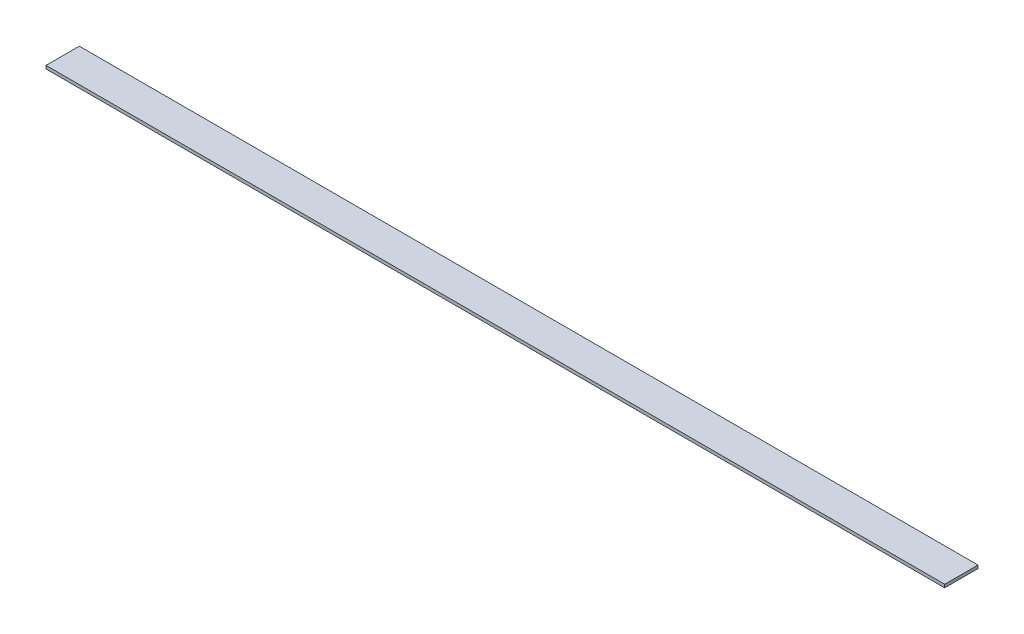
ISO-10303-21;
HEADER;
FILE_DESCRIPTION(('STEP AP214'),'2;1');
FILE_NAME('part.step','',(''),(''),'','','');
FILE_SCHEMA(('AUTOMOTIVE_DESIGN { 1 0 10303 214 1 1 1 1 }'));
ENDSEC;
DATA;
#1=APPLICATION_CONTEXT('core data for automotive mechanical design processes');
#2=APPLICATION_PROTOCOL_DEFINITION('international standard','automotive_design',2000,#1);
#3=PRODUCT_CONTEXT('',#1,'mechanical');
#4=PRODUCT('Part','Part','',(#3));
#5=PRODUCT_RELATED_PRODUCT_CATEGORY('part','',(#4));
#6=PRODUCT_DEFINITION_FORMATION('','',#4);
#7=PRODUCT_DEFINITION_CONTEXT('part definition',#1,'design');
#8=PRODUCT_DEFINITION('design','',#6,#7);
#9=PRODUCT_DEFINITION_SHAPE('','',#8);
#10=(LENGTH_UNIT() NAMED_UNIT(*) SI_UNIT(.MILLI.,.METRE.));
#11=(NAMED_UNIT(*) PLANE_ANGLE_UNIT() SI_UNIT($,.RADIAN.));
#12=(NAMED_UNIT(*) SI_UNIT($,.STERADIAN.) SOLID_ANGLE_UNIT());
#13=UNCERTAINTY_MEASURE_WITH_UNIT(LENGTH_MEASURE(1.E-05),#10,'distance_accuracy_value','');
#14=(GEOMETRIC_REPRESENTATION_CONTEXT(3) GLOBAL_UNCERTAINTY_ASSIGNED_CONTEXT((#13)) GLOBAL_UNIT_ASSIGNED_CONTEXT((#10,
#11,#12)) REPRESENTATION_CONTEXT('',''));
#15=CARTESIAN_POINT('',(0.,0.,0.));
#16=DIRECTION('',(0.,0.,1.));
#17=DIRECTION('',(1.,0.,0.));
#18=AXIS2_PLACEMENT_3D('',#15,#16,#17);
#19=CARTESIAN_POINT('',(0.,3.175,0.));
#20=DIRECTION('',(0.,0.,-1.));
#21=DIRECTION('',(-1.,0.,0.));
#22=AXIS2_PLACEMENT_3D('',#19,#20,#21);
#23=PLANE('',#22);
#24=DIRECTION('',(1.,0.,0.));
#25=VECTOR('',#24,1.);
#26=CARTESIAN_POINT('',(0.,0.,0.));
#27=LINE('',#26,#25);
#28=CARTESIAN_POINT('',(0.,0.,0.));
#29=VERTEX_POINT('',#28);
#30=CARTESIAN_POINT('',(917.575,0.,0.));
#31=VERTEX_POINT('',#30);
#32=EDGE_CURVE('E96',#29,#31,#27,.T.);
#33=ORIENTED_EDGE('',*,*,#32,.T.);
#34=DIRECTION('',(0.,-1.,0.));
#35=VECTOR('',#34,1.);
#36=CARTESIAN_POINT('',(917.575,3.175,0.));
#37=LINE('',#36,#35);
#38=CARTESIAN_POINT('',(917.575,3.175,0.));
#39=VERTEX_POINT('',#38);
#40=EDGE_CURVE('E11',#39,#31,#37,.T.);
#41=ORIENTED_EDGE('',*,*,#40,.F.);
#42=DIRECTION('',(1.,0.,0.));
#43=VECTOR('',#42,1.);
#44=CARTESIAN_POINT('',(0.,3.175,0.));
#45=LINE('',#44,#43);
#46=CARTESIAN_POINT('',(0.,3.175,0.));
#47=VERTEX_POINT('',#46);
#48=EDGE_CURVE('E82',#47,#39,#45,.T.);
#49=ORIENTED_EDGE('',*,*,#48,.F.);
#50=DIRECTION('',(0.,-1.,0.));
#51=VECTOR('',#50,1.);
#52=CARTESIAN_POINT('',(0.,3.175,0.));
#53=LINE('',#52,#51);
#54=EDGE_CURVE('E49',#47,#29,#53,.T.);
#55=ORIENTED_EDGE('',*,*,#54,.T.);
#56=EDGE_LOOP('',(#33,#41,#49,#55));
#57=FACE_BOUND('',#56,.T.);
#58=ADVANCED_FACE('F33',(#57),#23,.F.);
#59=CARTESIAN_POINT('',(917.575,3.175,0.));
#60=DIRECTION('',(-1.,0.,0.));
#61=DIRECTION('',(0.,0.,1.));
#62=AXIS2_PLACEMENT_3D('',#59,#60,#61);
#63=PLANE('',#62);
#64=DIRECTION('',(0.,0.,-1.));
#65=VECTOR('',#64,1.);
#66=CARTESIAN_POINT('',(917.575,0.,0.));
#67=LINE('',#66,#65);
#68=CARTESIAN_POINT('',(917.575,0.,-34.));
#69=VERTEX_POINT('',#68);
#70=EDGE_CURVE('E87',#31,#69,#67,.T.);
#71=ORIENTED_EDGE('',*,*,#70,.T.);
#72=DIRECTION('',(0.,-1.,0.));
#73=VECTOR('',#72,1.);
#74=CARTESIAN_POINT('',(917.575,3.175,-34.));
#75=LINE('',#74,#73);
#76=CARTESIAN_POINT('',(917.575,3.175,-34.));
#77=VERTEX_POINT('',#76);
#78=EDGE_CURVE('E41',#77,#69,#75,.T.);
#79=ORIENTED_EDGE('',*,*,#78,.F.);
#80=DIRECTION('',(0.,0.,-1.));
#81=VECTOR('',#80,1.);
#82=CARTESIAN_POINT('',(917.575,3.175,0.));
#83=LINE('',#82,#81);
#84=EDGE_CURVE('E74',#39,#77,#83,.T.);
#85=ORIENTED_EDGE('',*,*,#84,.F.);
#86=ORIENTED_EDGE('',*,*,#40,.T.);
#87=EDGE_LOOP('',(#71,#79,#85,#86));
#88=FACE_BOUND('',#87,.T.);
#89=ADVANCED_FACE('F86',(#88),#63,.F.);
#90=CARTESIAN_POINT('',(0.,3.175,-34.));
#91=DIRECTION('',(0.,0.,-1.));
#92=DIRECTION('',(-1.,0.,0.));
#93=AXIS2_PLACEMENT_3D('',#90,#91,#92);
#94=PLANE('',#93);
#95=DIRECTION('',(1.,0.,0.));
#96=VECTOR('',#95,1.);
#97=CARTESIAN_POINT('',(0.,0.,-34.));
#98=LINE('',#97,#96);
#99=CARTESIAN_POINT('',(0.,0.,-34.));
#100=VERTEX_POINT('',#99);
#101=EDGE_CURVE('E99',#100,#69,#98,.T.);
#102=ORIENTED_EDGE('',*,*,#101,.F.);
#103=DIRECTION('',(0.,-1.,0.));
#104=VECTOR('',#103,1.);
#105=CARTESIAN_POINT('',(0.,3.175,-34.));
#106=LINE('',#105,#104);
#107=CARTESIAN_POINT('',(0.,3.175,-34.));
#108=VERTEX_POINT('',#107);
#109=EDGE_CURVE('E63',#108,#100,#106,.T.);
#110=ORIENTED_EDGE('',*,*,#109,.F.);
#111=DIRECTION('',(1.,0.,0.));
#112=VECTOR('',#111,1.);
#113=CARTESIAN_POINT('',(0.,3.175,-34.));
#114=LINE('',#113,#112);
#115=EDGE_CURVE('E81',#108,#77,#114,.T.);
#116=ORIENTED_EDGE('',*,*,#115,.T.);
#117=ORIENTED_EDGE('',*,*,#78,.T.);
#118=EDGE_LOOP('',(#102,#110,#116,#117));
#119=FACE_BOUND('',#118,.T.);
#120=ADVANCED_FACE('F90',(#119),#94,.T.);
#121=CARTESIAN_POINT('',(0.,3.175,0.));
#122=DIRECTION('',(-1.,0.,0.));
#123=DIRECTION('',(0.,0.,1.));
#124=AXIS2_PLACEMENT_3D('',#121,#122,#123);
#125=PLANE('',#124);
#126=DIRECTION('',(0.,0.,-1.));
#127=VECTOR('',#126,1.);
#128=CARTESIAN_POINT('',(0.,0.,0.));
#129=LINE('',#128,#127);
#130=EDGE_CURVE('E101',#29,#100,#129,.T.);
#131=ORIENTED_EDGE('',*,*,#130,.F.);
#132=ORIENTED_EDGE('',*,*,#54,.F.);
#133=DIRECTION('',(0.,0.,-1.));
#134=VECTOR('',#133,1.);
#135=CARTESIAN_POINT('',(0.,3.175,0.));
#136=LINE('',#135,#134);
#137=EDGE_CURVE('E91',#47,#108,#136,.T.);
#138=ORIENTED_EDGE('',*,*,#137,.T.);
#139=ORIENTED_EDGE('',*,*,#109,.T.);
#140=EDGE_LOOP('',(#131,#132,#138,#139));
#141=FACE_BOUND('',#140,.T.);
#142=ADVANCED_FACE('F107',(#141),#125,.T.);
#143=CARTESIAN_POINT('',(0.,3.175,0.));
#144=DIRECTION('',(0.,1.,0.));
#145=DIRECTION('',(0.,0.,1.));
#146=AXIS2_PLACEMENT_3D('',#143,#144,#145);
#147=PLANE('',#146);
#148=ORIENTED_EDGE('',*,*,#48,.T.);
#149=ORIENTED_EDGE('',*,*,#84,.T.);
#150=ORIENTED_EDGE('',*,*,#115,.F.);
#151=ORIENTED_EDGE('',*,*,#137,.F.);
#152=EDGE_LOOP('',(#148,#149,#150,#151));
#153=FACE_BOUND('',#152,.T.);
#154=ADVANCED_FACE('F78',(#153),#147,.T.);
#155=CARTESIAN_POINT('',(0.,0.,0.));
#156=DIRECTION('',(0.,1.,0.));
#157=DIRECTION('',(0.,0.,1.));
#158=AXIS2_PLACEMENT_3D('',#155,#156,#157);
#159=PLANE('',#158);
#160=ORIENTED_EDGE('',*,*,#32,.F.);
#161=ORIENTED_EDGE('',*,*,#130,.T.);
#162=ORIENTED_EDGE('',*,*,#101,.T.);
#163=ORIENTED_EDGE('',*,*,#70,.F.);
#164=EDGE_LOOP('',(#160,#161,#162,#163));
#165=FACE_BOUND('',#164,.T.);
#166=ADVANCED_FACE('F106',(#165),#159,.F.);
#167=CLOSED_SHELL('',(#58,#89,#120,#142,#154,#166));
#168=MANIFOLD_SOLID_BREP('B2',#167);
#169=ADVANCED_BREP_SHAPE_REPRESENTATION('',(#18,#168),#14);
#170=SHAPE_DEFINITION_REPRESENTATION(#9,#169);
ENDSEC;
END-ISO-10303-21;
